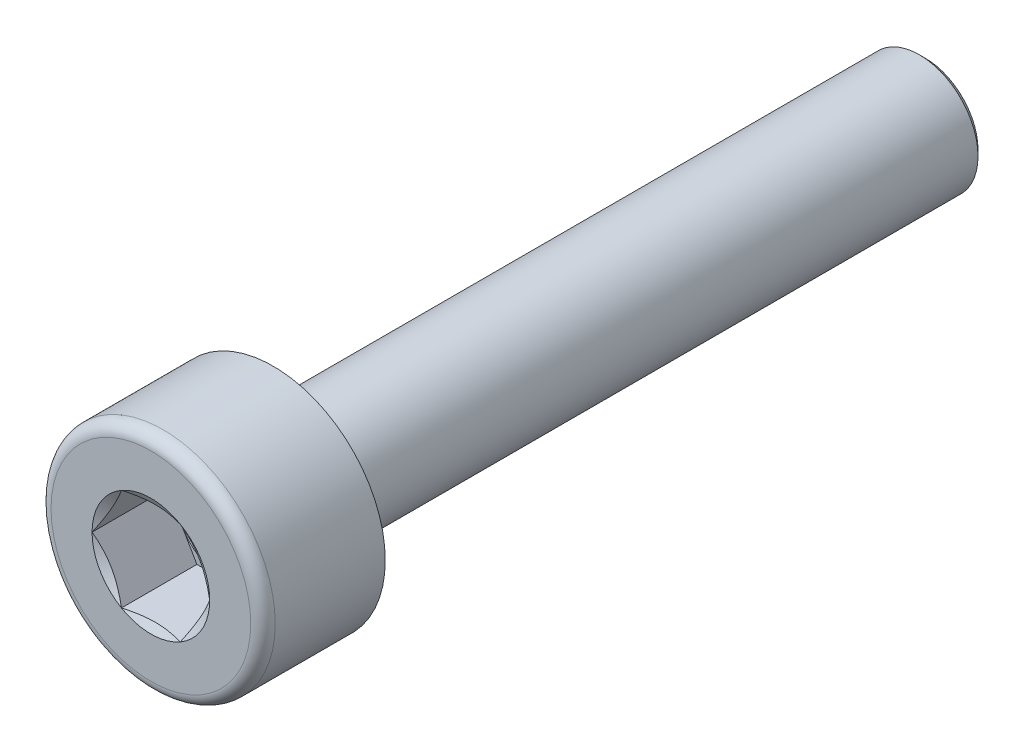
ISO-10303-21;
HEADER;
FILE_DESCRIPTION(('STEP AP214'),'2;1');
FILE_NAME('part.step','',(''),(''),'','','');
FILE_SCHEMA(('AUTOMOTIVE_DESIGN { 1 0 10303 214 1 1 1 1 }'));
ENDSEC;
DATA;
#1=APPLICATION_CONTEXT('core data for automotive mechanical design processes');
#2=APPLICATION_PROTOCOL_DEFINITION('international standard','automotive_design',2000,#1);
#3=PRODUCT_CONTEXT('',#1,'mechanical');
#4=PRODUCT('Part','Part','',(#3));
#5=PRODUCT_RELATED_PRODUCT_CATEGORY('part','',(#4));
#6=PRODUCT_DEFINITION_FORMATION('','',#4);
#7=PRODUCT_DEFINITION_CONTEXT('part definition',#1,'design');
#8=PRODUCT_DEFINITION('design','',#6,#7);
#9=PRODUCT_DEFINITION_SHAPE('','',#8);
#10=(LENGTH_UNIT() NAMED_UNIT(*) SI_UNIT(.MILLI.,.METRE.));
#11=(NAMED_UNIT(*) PLANE_ANGLE_UNIT() SI_UNIT($,.RADIAN.));
#12=(NAMED_UNIT(*) SI_UNIT($,.STERADIAN.) SOLID_ANGLE_UNIT());
#13=UNCERTAINTY_MEASURE_WITH_UNIT(LENGTH_MEASURE(1.E-05),#10,'distance_accuracy_value','');
#14=(GEOMETRIC_REPRESENTATION_CONTEXT(3) GLOBAL_UNCERTAINTY_ASSIGNED_CONTEXT((#13)) GLOBAL_UNIT_ASSIGNED_CONTEXT((#10,
#11,#12)) REPRESENTATION_CONTEXT('',''));
#15=CARTESIAN_POINT('',(0.,0.,0.));
#16=DIRECTION('',(0.,0.,1.));
#17=DIRECTION('',(1.,0.,0.));
#18=AXIS2_PLACEMENT_3D('',#15,#16,#17);
#19=CARTESIAN_POINT('',(0.,1.437,-16.));
#20=DIRECTION('',(0.,0.,1.));
#21=DIRECTION('',(1.,0.,0.));
#22=AXIS2_PLACEMENT_3D('',#19,#20,#21);
#23=PLANE('',#22);
#24=CARTESIAN_POINT('',(0.,0.,-16.));
#25=DIRECTION('',(0.,0.,1.));
#26=DIRECTION('',(1.,0.,0.));
#27=AXIS2_PLACEMENT_3D('',#24,#25,#26);
#28=CIRCLE('',#27,1.2933);
#29=CARTESIAN_POINT('',(1.2933,0.,-16.));
#30=VERTEX_POINT('',#29);
#31=EDGE_CURVE('E25',#30,#30,#28,.F.);
#32=ORIENTED_EDGE('',*,*,#31,.T.);
#33=EDGE_LOOP('',(#32));
#34=FACE_BOUND('',#33,.T.);
#35=ADVANCED_FACE('F17',(#34),#23,.F.);
#36=CARTESIAN_POINT('',(0.,0.,3.));
#37=DIRECTION('',(0.,0.,-1.));
#38=DIRECTION('',(-1.,0.,0.));
#39=AXIS2_PLACEMENT_3D('',#36,#37,#38);
#40=PLANE('',#39);
#41=CARTESIAN_POINT('',(0.,0.,3.));
#42=DIRECTION('',(0.,0.,-1.));
#43=DIRECTION('',(-1.,0.,0.));
#44=AXIS2_PLACEMENT_3D('',#41,#42,#43);
#45=CIRCLE('',#44,2.45);
#46=CARTESIAN_POINT('',(-2.45,0.,3.));
#47=VERTEX_POINT('',#46);
#48=EDGE_CURVE('E273',#47,#47,#45,.F.);
#49=ORIENTED_EDGE('',*,*,#48,.T.);
#50=EDGE_LOOP('',(#49));
#51=FACE_BOUND('',#50,.T.);
#52=CARTESIAN_POINT('',(0.,0.,3.));
#53=DIRECTION('',(0.,0.,-1.));
#54=DIRECTION('',(-1.,0.,0.));
#55=AXIS2_PLACEMENT_3D('',#52,#53,#54);
#56=CIRCLE('',#55,1.44337567297406);
#57=CARTESIAN_POINT('',(-0.721687836487033,-1.25,3.));
#58=VERTEX_POINT('',#57);
#59=CARTESIAN_POINT('',(-1.44337567297406,0.,3.));
#60=VERTEX_POINT('',#59);
#61=EDGE_CURVE('E284',#58,#60,#56,.T.);
#62=ORIENTED_EDGE('',*,*,#61,.T.);
#63=CARTESIAN_POINT('',(-0.72168783648703,1.25,3.));
#64=VERTEX_POINT('',#63);
#65=EDGE_CURVE('E107',#60,#64,#56,.T.);
#66=ORIENTED_EDGE('',*,*,#65,.T.);
#67=CARTESIAN_POINT('',(0.721687836487035,1.25,3.));
#68=VERTEX_POINT('',#67);
#69=EDGE_CURVE('E294',#64,#68,#56,.T.);
#70=ORIENTED_EDGE('',*,*,#69,.T.);
#71=CARTESIAN_POINT('',(1.44337567297406,0.,3.));
#72=VERTEX_POINT('',#71);
#73=EDGE_CURVE('E295',#68,#72,#56,.T.);
#74=ORIENTED_EDGE('',*,*,#73,.T.);
#75=CARTESIAN_POINT('',(0.721687836487033,-1.25,3.));
#76=VERTEX_POINT('',#75);
#77=EDGE_CURVE('E293',#72,#76,#56,.T.);
#78=ORIENTED_EDGE('',*,*,#77,.T.);
#79=EDGE_CURVE('E289',#76,#58,#56,.T.);
#80=ORIENTED_EDGE('',*,*,#79,.T.);
#81=EDGE_LOOP('',(#62,#66,#70,#74,#78,#80));
#82=FACE_BOUND('',#81,.T.);
#83=ADVANCED_FACE('F256',(#51,#82),#40,.F.);
#84=CARTESIAN_POINT('',(0.,0.,0.));
#85=DIRECTION('',(0.,0.,-1.));
#86=DIRECTION('',(-1.,0.,0.));
#87=AXIS2_PLACEMENT_3D('',#84,#85,#86);
#88=CYLINDRICAL_SURFACE('',#87,2.75);
#89=CARTESIAN_POINT('',(0.,0.,2.7));
#90=DIRECTION('',(0.,0.,-1.));
#91=DIRECTION('',(-1.,0.,0.));
#92=AXIS2_PLACEMENT_3D('',#89,#90,#91);
#93=CIRCLE('',#92,2.75);
#94=CARTESIAN_POINT('',(-2.75,0.,2.7));
#95=VERTEX_POINT('',#94);
#96=EDGE_CURVE('E175',#95,#95,#93,.T.);
#97=ORIENTED_EDGE('',*,*,#96,.T.);
#98=EDGE_LOOP('',(#97));
#99=FACE_BOUND('',#98,.T.);
#100=CARTESIAN_POINT('',(0.,0.,0.));
#101=DIRECTION('',(0.,0.,-1.));
#102=DIRECTION('',(-1.,0.,0.));
#103=AXIS2_PLACEMENT_3D('',#100,#101,#102);
#104=CIRCLE('',#103,2.75);
#105=CARTESIAN_POINT('',(-2.75,0.,0.));
#106=VERTEX_POINT('',#105);
#107=EDGE_CURVE('E117',#106,#106,#104,.T.);
#108=ORIENTED_EDGE('',*,*,#107,.F.);
#109=EDGE_LOOP('',(#108));
#110=FACE_BOUND('',#109,.T.);
#111=ADVANCED_FACE('F252',(#99,#110),#88,.T.);
#112=CARTESIAN_POINT('',(0.,2.75,0.));
#113=DIRECTION('',(0.,0.,1.));
#114=DIRECTION('',(1.,0.,0.));
#115=AXIS2_PLACEMENT_3D('',#112,#113,#114);
#116=PLANE('',#115);
#117=CARTESIAN_POINT('',(0.,0.,0.));
#118=DIRECTION('',(0.,0.,-1.));
#119=DIRECTION('',(-1.,0.,0.));
#120=AXIS2_PLACEMENT_3D('',#117,#118,#119);
#121=CIRCLE('',#120,1.8);
#122=CARTESIAN_POINT('',(-1.8,0.,0.));
#123=VERTEX_POINT('',#122);
#124=EDGE_CURVE('E161',#123,#123,#121,.T.);
#125=ORIENTED_EDGE('',*,*,#124,.F.);
#126=EDGE_LOOP('',(#125));
#127=FACE_BOUND('',#126,.T.);
#128=ORIENTED_EDGE('',*,*,#107,.T.);
#129=EDGE_LOOP('',(#128));
#130=FACE_BOUND('',#129,.T.);
#131=ADVANCED_FACE('F248',(#127,#130),#116,.F.);
#132=CARTESIAN_POINT('',(0.,0.,-0.100000000000001));
#133=DIRECTION('',(0.,0.,-1.));
#134=DIRECTION('',(-1.,0.,0.));
#135=AXIS2_PLACEMENT_3D('',#132,#133,#134);
#136=TOROIDAL_SURFACE('',#135,1.8,0.100000000000001);
#137=CARTESIAN_POINT('',(0.,0.,-0.0460072747777011));
#138=DIRECTION('',(0.,0.,-1.));
#139=DIRECTION('',(-1.,0.,0.));
#140=AXIS2_PLACEMENT_3D('',#137,#138,#139);
#141=CIRCLE('',#140,1.71582883140249);
#142=CARTESIAN_POINT('',(-1.71582883140249,0.,-0.0460072747777011));
#143=VERTEX_POINT('',#142);
#144=EDGE_CURVE('E158',#143,#143,#141,.T.);
#145=ORIENTED_EDGE('',*,*,#144,.F.);
#146=EDGE_LOOP('',(#145));
#147=FACE_BOUND('',#146,.T.);
#148=ORIENTED_EDGE('',*,*,#124,.T.);
#149=EDGE_LOOP('',(#148));
#150=FACE_BOUND('',#149,.T.);
#151=ADVANCED_FACE('F244',(#147,#150),#136,.F.);
#152=CARTESIAN_POINT('',(0.,0.,-0.0460072747777011));
#153=DIRECTION('',(0.,0.,1.));
#154=DIRECTION('',(1.,0.,0.));
#155=AXIS2_PLACEMENT_3D('',#152,#153,#154);
#156=CONICAL_SURFACE('',#155,1.71582883140249,0.570350678624392);
#157=CARTESIAN_POINT('',(0.,0.,-0.456007274777701));
#158=DIRECTION('',(0.,0.,-1.));
#159=DIRECTION('',(-1.,0.,0.));
#160=AXIS2_PLACEMENT_3D('',#157,#158,#159);
#161=CIRCLE('',#160,1.4528288314025);
#162=CARTESIAN_POINT('',(-1.4528288314025,0.,-0.456007274777701));
#163=VERTEX_POINT('',#162);
#164=EDGE_CURVE('E155',#163,#163,#161,.T.);
#165=ORIENTED_EDGE('',*,*,#164,.F.);
#166=EDGE_LOOP('',(#165));
#167=FACE_BOUND('',#166,.T.);
#168=ORIENTED_EDGE('',*,*,#144,.T.);
#169=EDGE_LOOP('',(#168));
#170=FACE_BOUND('',#169,.T.);
#171=ADVANCED_FACE('F240',(#167,#170),#156,.T.);
#172=CARTESIAN_POINT('',(0.,0.,-0.51));
#173=DIRECTION('',(0.,0.,-1.));
#174=DIRECTION('',(-1.,0.,0.));
#175=AXIS2_PLACEMENT_3D('',#172,#173,#174);
#176=TOROIDAL_SURFACE('',#175,1.537,0.1);
#177=CARTESIAN_POINT('',(0.,0.,-0.51));
#178=DIRECTION('',(0.,0.,-1.));
#179=DIRECTION('',(-1.,0.,0.));
#180=AXIS2_PLACEMENT_3D('',#177,#178,#179);
#181=CIRCLE('',#180,1.437);
#182=CARTESIAN_POINT('',(-1.437,0.,-0.51));
#183=VERTEX_POINT('',#182);
#184=EDGE_CURVE('E151',#183,#183,#181,.T.);
#185=ORIENTED_EDGE('',*,*,#184,.F.);
#186=EDGE_LOOP('',(#185));
#187=FACE_BOUND('',#186,.T.);
#188=ORIENTED_EDGE('',*,*,#164,.T.);
#189=EDGE_LOOP('',(#188));
#190=FACE_BOUND('',#189,.T.);
#191=ADVANCED_FACE('F236',(#187,#190),#176,.F.);
#192=CARTESIAN_POINT('',(0.,0.,0.));
#193=DIRECTION('',(0.,0.,-1.));
#194=DIRECTION('',(-1.,0.,0.));
#195=AXIS2_PLACEMENT_3D('',#192,#193,#194);
#196=CYLINDRICAL_SURFACE('',#195,1.437);
#197=CARTESIAN_POINT('',(0.,0.,-15.8563));
#198=DIRECTION('',(0.,0.,1.));
#199=DIRECTION('',(1.,0.,0.));
#200=AXIS2_PLACEMENT_3D('',#197,#198,#199);
#201=CIRCLE('',#200,1.437);
#202=CARTESIAN_POINT('',(1.437,0.,-15.8563));
#203=VERTEX_POINT('',#202);
#204=EDGE_CURVE('E11',#203,#203,#201,.T.);
#205=ORIENTED_EDGE('',*,*,#204,.T.);
#206=EDGE_LOOP('',(#205));
#207=FACE_BOUND('',#206,.T.);
#208=ORIENTED_EDGE('',*,*,#184,.T.);
#209=EDGE_LOOP('',(#208));
#210=FACE_BOUND('',#209,.T.);
#211=ADVANCED_FACE('F233',(#207,#210),#196,.T.);
#212=CARTESIAN_POINT('',(0.,0.,3.));
#213=DIRECTION('',(0.,0.,1.));
#214=DIRECTION('',(1.,0.,0.));
#215=AXIS2_PLACEMENT_3D('',#212,#213,#214);
#216=CONICAL_SURFACE('',#215,1.44337567297406,1.04719755119659);
#217=ORIENTED_EDGE('',*,*,#65,.F.);
#218=CARTESIAN_POINT('',(-1.4434911430279,-0.000199999999997675,3.00006667466602));
#219=CARTESIAN_POINT('',(-1.41177538446487,0.0547333052317676,2.98174591476369));
#220=CARTESIAN_POINT('',(-1.37978586023939,0.110140786500242,2.96508330620064));
#221=CARTESIAN_POINT('',(-1.31525277575269,0.221915367600343,2.93599730394577));
#222=CARTESIAN_POINT('',(-1.28270806805991,0.278284454841713,2.92358420197605));
#223=CARTESIAN_POINT('',(-1.21802202146378,0.390323974086987,2.90425968763601));
#224=CARTESIAN_POINT('',(-1.1858906404852,0.445977158459233,2.89721968944743));
#225=CARTESIAN_POINT('',(-1.12147653960455,0.557545653908395,2.88881243263063));
#226=CARTESIAN_POINT('',(-1.08919405413422,0.613460558937603,2.88743821520472));
#227=CARTESIAN_POINT('',(-1.02886247391297,0.717957921181728,2.89028333736792));
#228=CARTESIAN_POINT('',(-1.00080438896118,0.766555949881318,2.89380409882001));
#229=CARTESIAN_POINT('',(-0.944871034195502,0.863435362173241,2.90496711269925));
#230=CARTESIAN_POINT('',(-0.916995958125019,0.911716410192166,2.91261318557268));
#231=CARTESIAN_POINT('',(-0.860947097873546,1.00879588385404,2.93172945470053));
#232=CARTESIAN_POINT('',(-0.832780414607289,1.0575820103519,2.94328075697966));
#233=CARTESIAN_POINT('',(-0.776867365453648,1.1544262522921,2.96949831469389));
#234=CARTESIAN_POINT('',(-0.74912028215514,1.20248561032696,2.9841584021391));
#235=CARTESIAN_POINT('',(-0.721572366433193,1.2502,3.00006667466602));
#236=B_SPLINE_CURVE_WITH_KNOTS('',3,(#218,#219,#220,#221,#222,#223,#224,#225,#226,#227,#228,
#229,#230,#231,#232,#233,#234,#235),.UNSPECIFIED.,.F.,.F.,(4,2,2,2,2,2,2,2,4),(0.,
0.19815082102956,0.396778196315221,0.590488617354401,0.783961049317183,0.952480056398647,
1.1211553973001,1.2935743034359,1.4656542697693),.UNSPECIFIED.);
#237=EDGE_CURVE('E166',#60,#64,#236,.T.);
#238=ORIENTED_EDGE('',*,*,#237,.T.);
#239=EDGE_LOOP('',(#217,#238));
#240=FACE_BOUND('',#239,.T.);
#241=ADVANCED_FACE('F184',(#240),#216,.F.);
#242=CARTESIAN_POINT('',(-0.721572366433195,-1.2502,3.00006667466602));
#243=CARTESIAN_POINT('',(-0.753288124996231,-1.19526669476823,2.98174591476369));
#244=CARTESIAN_POINT('',(-0.785277649221704,-1.13985921349976,2.96508330620064));
#245=CARTESIAN_POINT('',(-0.849810733708404,-1.02808463239966,2.93599730394577));
#246=CARTESIAN_POINT('',(-0.882355441401183,-0.971715545158289,2.92358420197605));
#247=CARTESIAN_POINT('',(-0.947041487997319,-0.859676025913014,2.90425968763601));
#248=CARTESIAN_POINT('',(-0.979172868975895,-0.804022841540769,2.89721968944743));
#249=CARTESIAN_POINT('',(-1.04358696985655,-0.692454346091607,2.88881243263063));
#250=CARTESIAN_POINT('',(-1.07586945532688,-0.636539441062398,2.88743821520472));
#251=CARTESIAN_POINT('',(-1.13620103554813,-0.532042078818273,2.89028333736791));
#252=CARTESIAN_POINT('',(-1.16425912049992,-0.483444050118683,2.89380409882001));
#253=CARTESIAN_POINT('',(-1.22019247526559,-0.386564637826761,2.90496711269926));
#254=CARTESIAN_POINT('',(-1.24806755133608,-0.338283589807835,2.91261318557268));
#255=CARTESIAN_POINT('',(-1.30411641158755,-0.241204116145956,2.93172945470053));
#256=CARTESIAN_POINT('',(-1.33228309485381,-0.1924179896481,2.94328075697966));
#257=CARTESIAN_POINT('',(-1.38819614400745,-0.0955737477078969,2.96949831469389));
#258=CARTESIAN_POINT('',(-1.41594322730596,-0.0475143896730343,2.98415840213911));
#259=CARTESIAN_POINT('',(-1.4434911430279,0.000200000000002268,3.00006667466602));
#260=B_SPLINE_CURVE_WITH_KNOTS('',3,(#242,#243,#244,#245,#246,#247,#248,#249,#250,#251,#252,
#253,#254,#255,#256,#257,#258,#259),.UNSPECIFIED.,.F.,.F.,(4,2,2,2,2,2,2,2,4),(0.,
0.19815082102956,0.396778196315222,0.590488617354402,0.783961049317184,0.952480056398648,
1.1211553973001,1.2935743034359,1.4656542697693),.UNSPECIFIED.);
#261=EDGE_CURVE('E106',#58,#60,#260,.T.);
#262=ORIENTED_EDGE('',*,*,#261,.T.);
#263=ORIENTED_EDGE('',*,*,#61,.F.);
#264=EDGE_LOOP('',(#262,#263));
#265=FACE_BOUND('',#264,.T.);
#266=ADVANCED_FACE('F339',(#265),#216,.F.);
#267=CARTESIAN_POINT('',(-1.91402249686216,-1.25,3.48651288479141));
#268=CARTESIAN_POINT('',(-1.85914046049582,-1.25,3.45999038335154));
#269=CARTESIAN_POINT('',(-1.80412861642413,-1.25,3.43373221461557));
#270=CARTESIAN_POINT('',(-1.69377524880197,-1.25,3.38189383879485));
#271=CARTESIAN_POINT('',(-1.63843367017623,-1.25,3.35631374909162));
#272=CARTESIAN_POINT('',(-1.52705181896546,-1.25,3.30584606568502));
#273=CARTESIAN_POINT('',(-1.471009360369,-1.25,3.28096327255609));
#274=CARTESIAN_POINT('',(-1.3584634322514,-1.25,3.23227191506865));
#275=CARTESIAN_POINT('',(-1.30195998694251,-1.25,3.20846329471518));
#276=CARTESIAN_POINT('',(-1.13023285932381,-1.25,3.13847265448235));
#277=CARTESIAN_POINT('',(-1.01415191825627,-1.25,3.09435658102078));
#278=CARTESIAN_POINT('',(-0.779052794443726,-1.25,3.01526341646949));
#279=CARTESIAN_POINT('',(-0.660042536750821,-1.25,2.98026411818164));
#280=CARTESIAN_POINT('',(-0.47893263622699,-1.25,2.93885499673143));
#281=CARTESIAN_POINT('',(-0.418117317139982,-1.25,2.92689892661569));
#282=CARTESIAN_POINT('',(-0.295751634794787,-1.25,2.90750168027795));
#283=CARTESIAN_POINT('',(-0.234201270886778,-1.25,2.90006050804768));
#284=CARTESIAN_POINT('',(-0.111078085132805,-1.25,2.89034953143358));
#285=CARTESIAN_POINT('',(-0.0495079196542184,-1.25,2.88804698816604));
#286=CARTESIAN_POINT('',(0.0735831621738639,-1.25,2.88872894537047));
#287=CARTESIAN_POINT('',(0.135104087159245,-1.25,2.89171207343273));
#288=CARTESIAN_POINT('',(0.283935785341007,-1.25,2.90505722791002));
#289=CARTESIAN_POINT('',(0.371012804095998,-1.25,2.91803134932696));
#290=CARTESIAN_POINT('',(0.543555810943381,-1.25,2.95222917957144));
#291=CARTESIAN_POINT('',(0.629019779096373,-1.25,2.9734625943366));
#292=CARTESIAN_POINT('',(0.756929416866877,-1.25,3.01007884490288));
#293=CARTESIAN_POINT('',(0.800029095074483,-1.25,3.02326523899134));
#294=CARTESIAN_POINT('',(0.885776202763547,-1.25,3.05094330554174));
#295=CARTESIAN_POINT('',(0.928423921808507,-1.25,3.06543407771215));
#296=CARTESIAN_POINT('',(1.01309180163563,-1.25,3.09541882069064));
#297=CARTESIAN_POINT('',(1.05511414357455,-1.25,3.11090668572693));
#298=CARTESIAN_POINT('',(1.13883279115284,-1.25,3.14279147043058));
#299=CARTESIAN_POINT('',(1.1805289571388,-1.25,3.15918875750689));
#300=CARTESIAN_POINT('',(1.22207405933337,-1.25,3.175951067698));
#301=B_SPLINE_CURVE_WITH_KNOTS('',3,(#267,#268,#269,#270,#271,#272,#273,#274,#275,#276,#277,
#278,#279,#280,#281,#282,#283,#284,#285,#286,#287,#288,#289,#290,#291,#292,#293,#294,#295,#296,
#297,#298,#299,#300),.UNSPECIFIED.,.F.,.F.,(4,2,2,2,2,2,2,2,2,2,2,2,2,2,2,2,4),(0.,
0.182866185166336,0.365763822062273,0.549708108268721,0.733642794640087,1.10600436119169,
1.47745024072251,1.66325057096118,1.84905106547046,2.03366437966803,2.21822976656131,
2.48180397426805,2.74568886248364,2.88088820791444,3.01599494297259,3.15034120655594,
3.28474214746062),.UNSPECIFIED.);
#302=EDGE_CURVE('E197',#76,#58,#301,.F.);
#303=ORIENTED_EDGE('',*,*,#302,.T.);
#304=ORIENTED_EDGE('',*,*,#79,.F.);
#305=EDGE_LOOP('',(#303,#304));
#306=FACE_BOUND('',#305,.T.);
#307=ADVANCED_FACE('F343',(#306),#216,.F.);
#308=CARTESIAN_POINT('',(1.4434911430279,0.000199999999998967,3.00006667466602));
#309=CARTESIAN_POINT('',(1.41177538446487,-0.0547333052317663,2.98174591476369));
#310=CARTESIAN_POINT('',(1.37978586023939,-0.110140786500241,2.96508330620064));
#311=CARTESIAN_POINT('',(1.31525277575269,-0.221915367600341,2.93599730394577));
#312=CARTESIAN_POINT('',(1.28270806805991,-0.278284454841712,2.92358420197605));
#313=CARTESIAN_POINT('',(1.21802202146378,-0.390323974086986,2.90425968763601));
#314=CARTESIAN_POINT('',(1.1858906404852,-0.445977158459232,2.89721968944743));
#315=CARTESIAN_POINT('',(1.12147653960455,-0.557545653908394,2.88881243263063));
#316=CARTESIAN_POINT('',(1.08919405413422,-0.613460558937602,2.88743821520472));
#317=CARTESIAN_POINT('',(1.02886247391297,-0.717957921181727,2.89028333736791));
#318=CARTESIAN_POINT('',(1.00080438896118,-0.766555949881317,2.89380409882001));
#319=CARTESIAN_POINT('',(0.944871034195502,-0.863435362173239,2.90496711269925));
#320=CARTESIAN_POINT('',(0.916995958125019,-0.911716410192164,2.91261318557268));
#321=CARTESIAN_POINT('',(0.860947097873545,-1.00879588385404,2.93172945470053));
#322=CARTESIAN_POINT('',(0.832780414607289,-1.0575820103519,2.94328075697966));
#323=CARTESIAN_POINT('',(0.776867365453648,-1.1544262522921,2.96949831469389));
#324=CARTESIAN_POINT('',(0.749120282155139,-1.20248561032696,2.9841584021391));
#325=CARTESIAN_POINT('',(0.721572366433193,-1.2502,3.00006667466602));
#326=B_SPLINE_CURVE_WITH_KNOTS('',3,(#308,#309,#310,#311,#312,#313,#314,#315,#316,#317,#318,
#319,#320,#321,#322,#323,#324,#325),.UNSPECIFIED.,.F.,.F.,(4,2,2,2,2,2,2,2,4),(0.,
0.19815082102956,0.396778196315222,0.590488617354401,0.783961049317183,0.952480056398647,
1.1211553973001,1.2935743034359,1.4656542697693),.UNSPECIFIED.);
#327=EDGE_CURVE('E204',#72,#76,#326,.T.);
#328=ORIENTED_EDGE('',*,*,#327,.T.);
#329=ORIENTED_EDGE('',*,*,#77,.F.);
#330=EDGE_LOOP('',(#328,#329));
#331=FACE_BOUND('',#330,.T.);
#332=ADVANCED_FACE('F299',(#331),#216,.F.);
#333=CARTESIAN_POINT('',(0.721572366433196,1.2502,3.00006667466602));
#334=CARTESIAN_POINT('',(0.753288124996232,1.19526669476823,2.98174591476369));
#335=CARTESIAN_POINT('',(0.785277649221705,1.13985921349976,2.96508330620064));
#336=CARTESIAN_POINT('',(0.849810733708406,1.02808463239966,2.93599730394577));
#337=CARTESIAN_POINT('',(0.882355441401184,0.971715545158289,2.92358420197605));
#338=CARTESIAN_POINT('',(0.94704148799732,0.859676025913015,2.90425968763601));
#339=CARTESIAN_POINT('',(0.979172868975896,0.80402284154077,2.89721968944743));
#340=CARTESIAN_POINT('',(1.04358696985655,0.692454346091607,2.88881243263063));
#341=CARTESIAN_POINT('',(1.07586945532687,0.636539441062397,2.88743821520472));
#342=CARTESIAN_POINT('',(1.13620103554813,0.532042078818272,2.89028333736792));
#343=CARTESIAN_POINT('',(1.16425912049992,0.483444050118682,2.89380409882001));
#344=CARTESIAN_POINT('',(1.2201924752656,0.38656463782676,2.90496711269925));
#345=CARTESIAN_POINT('',(1.24806755133608,0.338283589807835,2.91261318557268));
#346=CARTESIAN_POINT('',(1.30411641158755,0.241204116145956,2.93172945470053));
#347=CARTESIAN_POINT('',(1.33228309485381,0.1924179896481,2.94328075697966));
#348=CARTESIAN_POINT('',(1.38819614400745,0.0955737477078979,2.96949831469389));
#349=CARTESIAN_POINT('',(1.41594322730596,0.0475143896730355,2.98415840213911));
#350=CARTESIAN_POINT('',(1.4434911430279,-0.00020000000000122,3.00006667466602));
#351=B_SPLINE_CURVE_WITH_KNOTS('',3,(#333,#334,#335,#336,#337,#338,#339,#340,#341,#342,#343,
#344,#345,#346,#347,#348,#349,#350),.UNSPECIFIED.,.F.,.F.,(4,2,2,2,2,2,2,2,4),(0.,
0.19815082102956,0.396778196315222,0.590488617354401,0.783961049317184,0.952480056398648,
1.1211553973001,1.2935743034359,1.4656542697693),.UNSPECIFIED.);
#352=EDGE_CURVE('E37',#68,#72,#351,.T.);
#353=ORIENTED_EDGE('',*,*,#352,.T.);
#354=ORIENTED_EDGE('',*,*,#73,.F.);
#355=EDGE_LOOP('',(#353,#354));
#356=FACE_BOUND('',#355,.T.);
#357=ADVANCED_FACE('F183',(#356),#216,.F.);
#358=CARTESIAN_POINT('',(-1.91402249686216,1.25,3.48651288479141));
#359=CARTESIAN_POINT('',(-1.85914046049581,1.25,3.45999038335154));
#360=CARTESIAN_POINT('',(-1.80412861642413,1.25,3.43373221461557));
#361=CARTESIAN_POINT('',(-1.69377524880197,1.25,3.38189383879485));
#362=CARTESIAN_POINT('',(-1.63843367017622,1.25,3.35631374909161));
#363=CARTESIAN_POINT('',(-1.52705181896546,1.25,3.30584606568501));
#364=CARTESIAN_POINT('',(-1.471009360369,1.25,3.28096327255609));
#365=CARTESIAN_POINT('',(-1.35846343225139,1.25,3.23227191506865));
#366=CARTESIAN_POINT('',(-1.3019599869425,1.25,3.20846329471518));
#367=CARTESIAN_POINT('',(-1.13023285932381,1.25,3.13847265448235));
#368=CARTESIAN_POINT('',(-1.01415191825627,1.25,3.09435658102077));
#369=CARTESIAN_POINT('',(-0.779052794443723,1.25,3.01526341646949));
#370=CARTESIAN_POINT('',(-0.660042536750817,1.25,2.98026411818164));
#371=CARTESIAN_POINT('',(-0.478932636226987,1.25,2.93885499673143));
#372=CARTESIAN_POINT('',(-0.418117317139979,1.25,2.92689892661569));
#373=CARTESIAN_POINT('',(-0.295751634794785,1.25,2.90750168027795));
#374=CARTESIAN_POINT('',(-0.234201270886775,1.25,2.90006050804768));
#375=CARTESIAN_POINT('',(-0.111078085132802,1.25,2.89034953143358));
#376=CARTESIAN_POINT('',(-0.0495079196542156,1.25,2.88804698816604));
#377=CARTESIAN_POINT('',(0.0735831621738667,1.25,2.88872894537047));
#378=CARTESIAN_POINT('',(0.135104087159248,1.25,2.89171207343273));
#379=CARTESIAN_POINT('',(0.283935785341009,1.25,2.90505722791002));
#380=CARTESIAN_POINT('',(0.371012804096,1.25,2.91803134932696));
#381=CARTESIAN_POINT('',(0.543555810943384,1.25,2.95222917957144));
#382=CARTESIAN_POINT('',(0.629019779096376,1.25,2.9734625943366));
#383=CARTESIAN_POINT('',(0.75692941686688,1.25,3.01007884490288));
#384=CARTESIAN_POINT('',(0.800029095074486,1.25,3.02326523899134));
#385=CARTESIAN_POINT('',(0.88577620276355,1.25,3.05094330554174));
#386=CARTESIAN_POINT('',(0.92842392180851,1.25,3.06543407771215));
#387=CARTESIAN_POINT('',(1.01309180163563,1.25,3.09541882069064));
#388=CARTESIAN_POINT('',(1.05511414357455,1.25,3.11090668572694));
#389=CARTESIAN_POINT('',(1.13883279115285,1.25,3.14279147043058));
#390=CARTESIAN_POINT('',(1.1805289571388,1.25,3.15918875750689));
#391=CARTESIAN_POINT('',(1.22207405933337,1.25,3.175951067698));
#392=B_SPLINE_CURVE_WITH_KNOTS('',3,(#358,#359,#360,#361,#362,#363,#364,#365,#366,#367,#368,
#369,#370,#371,#372,#373,#374,#375,#376,#377,#378,#379,#380,#381,#382,#383,#384,#385,#386,#387,
#388,#389,#390,#391),.UNSPECIFIED.,.F.,.F.,(4,2,2,2,2,2,2,2,2,2,2,2,2,2,2,2,4),(0.,
0.182866185166335,0.365763822062272,0.549708108268719,0.733642794640086,1.10600436119169,
1.47745024072251,1.66325057096118,1.84905106547045,2.03366437966803,2.21822976656131,
2.48180397426804,2.74568886248363,2.88088820791444,3.01599494297259,3.15034120655594,
3.28474214746062),.UNSPECIFIED.);
#393=EDGE_CURVE('E31',#64,#68,#392,.T.);
#394=ORIENTED_EDGE('',*,*,#393,.T.);
#395=ORIENTED_EDGE('',*,*,#69,.F.);
#396=EDGE_LOOP('',(#394,#395));
#397=FACE_BOUND('',#396,.T.);
#398=ADVANCED_FACE('F180',(#397),#216,.F.);
#399=CARTESIAN_POINT('',(0.721687836487034,1.25,1.15));
#400=DIRECTION('',(0.,0.,-1.));
#401=DIRECTION('',(-1.,0.,0.));
#402=AXIS2_PLACEMENT_3D('',#399,#400,#401);
#403=PLANE('',#402);
#404=CARTESIAN_POINT('',(0.,0.,1.15));
#405=DIRECTION('',(0.,0.,-1.));
#406=DIRECTION('',(-1.,0.,0.));
#407=AXIS2_PLACEMENT_3D('',#404,#405,#406);
#408=CIRCLE('',#407,1.25);
#409=CARTESIAN_POINT('',(-1.08253175473055,0.625,1.15));
#410=VERTEX_POINT('',#409);
#411=CARTESIAN_POINT('',(0.,1.25,1.15));
#412=VERTEX_POINT('',#411);
#413=EDGE_CURVE('E96',#410,#412,#408,.T.);
#414=ORIENTED_EDGE('',*,*,#413,.T.);
#415=DIRECTION('',(1.,0.,0.));
#416=VECTOR('',#415,1.);
#417=CARTESIAN_POINT('',(-0.721687836487031,1.25,1.15));
#418=LINE('',#417,#416);
#419=CARTESIAN_POINT('',(-0.721687836487031,1.25,1.15));
#420=VERTEX_POINT('',#419);
#421=EDGE_CURVE('E123',#420,#412,#418,.T.);
#422=ORIENTED_EDGE('',*,*,#421,.F.);
#423=DIRECTION('',(0.5,0.866025403784438,0.));
#424=VECTOR('',#423,1.);
#425=CARTESIAN_POINT('',(-1.44337567297406,0.,1.15));
#426=LINE('',#425,#424);
#427=EDGE_CURVE('E120',#410,#420,#426,.T.);
#428=ORIENTED_EDGE('',*,*,#427,.F.);
#429=EDGE_LOOP('',(#414,#422,#428));
#430=FACE_BOUND('',#429,.T.);
#431=ADVANCED_FACE('F121',(#430),#403,.F.);
#432=CARTESIAN_POINT('',(0.,0.,1.15));
#433=DIRECTION('',(0.,0.,-1.));
#434=DIRECTION('',(-1.,0.,0.));
#435=AXIS2_PLACEMENT_3D('',#432,#433,#434);
#436=CIRCLE('',#435,1.25);
#437=CARTESIAN_POINT('',(-1.08253175473055,-0.625,1.15));
#438=VERTEX_POINT('',#437);
#439=EDGE_CURVE('E98',#410,#438,#436,.F.);
#440=ORIENTED_EDGE('',*,*,#439,.F.);
#441=CARTESIAN_POINT('',(-1.44337567297406,0.,1.15));
#442=VERTEX_POINT('',#441);
#443=EDGE_CURVE('E114',#442,#410,#426,.T.);
#444=ORIENTED_EDGE('',*,*,#443,.F.);
#445=DIRECTION('',(-0.5,0.866025403784439,0.));
#446=VECTOR('',#445,1.);
#447=CARTESIAN_POINT('',(-0.721687836487033,-1.25,1.15));
#448=LINE('',#447,#446);
#449=EDGE_CURVE('E115',#438,#442,#448,.T.);
#450=ORIENTED_EDGE('',*,*,#449,.F.);
#451=EDGE_LOOP('',(#440,#444,#450));
#452=FACE_BOUND('',#451,.T.);
#453=ADVANCED_FACE('F112',(#452),#403,.F.);
#454=CARTESIAN_POINT('',(-1.44337567297406,0.,3.));
#455=DIRECTION('',(-0.866025403784438,0.5,0.));
#456=DIRECTION('',(-0.5,-0.866025403784438,0.));
#457=AXIS2_PLACEMENT_3D('',#454,#455,#456);
#458=PLANE('',#457);
#459=ORIENTED_EDGE('',*,*,#443,.T.);
#460=ORIENTED_EDGE('',*,*,#427,.T.);
#461=DIRECTION('',(0.,0.,-1.));
#462=VECTOR('',#461,1.);
#463=CARTESIAN_POINT('',(-0.721687836487031,1.25,3.));
#464=LINE('',#463,#462);
#465=EDGE_CURVE('E134',#64,#420,#464,.T.);
#466=ORIENTED_EDGE('',*,*,#465,.F.);
#467=ORIENTED_EDGE('',*,*,#237,.F.);
#468=DIRECTION('',(0.,0.,-1.));
#469=VECTOR('',#468,1.);
#470=CARTESIAN_POINT('',(-1.44337567297406,0.,3.));
#471=LINE('',#470,#469);
#472=EDGE_CURVE('E133',#60,#442,#471,.T.);
#473=ORIENTED_EDGE('',*,*,#472,.T.);
#474=EDGE_LOOP('',(#459,#460,#466,#467,#473));
#475=FACE_BOUND('',#474,.T.);
#476=ADVANCED_FACE('F130',(#475),#458,.F.);
#477=CARTESIAN_POINT('',(0.,-1.25,1.15));
#478=VERTEX_POINT('',#477);
#479=EDGE_CURVE('E119',#438,#478,#436,.F.);
#480=ORIENTED_EDGE('',*,*,#479,.F.);
#481=CARTESIAN_POINT('',(-0.721687836487033,-1.25,1.15));
#482=VERTEX_POINT('',#481);
#483=EDGE_CURVE('E127',#482,#438,#448,.T.);
#484=ORIENTED_EDGE('',*,*,#483,.F.);
#485=DIRECTION('',(-1.,0.,0.));
#486=VECTOR('',#485,1.);
#487=CARTESIAN_POINT('',(0.721687836487031,-1.25,1.15));
#488=LINE('',#487,#486);
#489=EDGE_CURVE('E318',#478,#482,#488,.T.);
#490=ORIENTED_EDGE('',*,*,#489,.F.);
#491=EDGE_LOOP('',(#480,#484,#490));
#492=FACE_BOUND('',#491,.T.);
#493=ADVANCED_FACE('F331',(#492),#403,.F.);
#494=CARTESIAN_POINT('',(-0.721687836487033,-1.25,3.));
#495=DIRECTION('',(-0.866025403784439,-0.5,0.));
#496=DIRECTION('',(0.5,-0.866025403784439,0.));
#497=AXIS2_PLACEMENT_3D('',#494,#495,#496);
#498=PLANE('',#497);
#499=ORIENTED_EDGE('',*,*,#483,.T.);
#500=ORIENTED_EDGE('',*,*,#449,.T.);
#501=ORIENTED_EDGE('',*,*,#472,.F.);
#502=ORIENTED_EDGE('',*,*,#261,.F.);
#503=DIRECTION('',(0.,0.,-1.));
#504=VECTOR('',#503,1.);
#505=CARTESIAN_POINT('',(-0.721687836487033,-1.25,3.));
#506=LINE('',#505,#504);
#507=EDGE_CURVE('E140',#58,#482,#506,.T.);
#508=ORIENTED_EDGE('',*,*,#507,.T.);
#509=EDGE_LOOP('',(#499,#500,#501,#502,#508));
#510=FACE_BOUND('',#509,.T.);
#511=ADVANCED_FACE('F330',(#510),#498,.F.);
#512=CARTESIAN_POINT('',(1.08253175473055,-0.625,1.15));
#513=VERTEX_POINT('',#512);
#514=EDGE_CURVE('E333',#478,#513,#436,.F.);
#515=ORIENTED_EDGE('',*,*,#514,.F.);
#516=CARTESIAN_POINT('',(0.721687836487031,-1.25,1.15));
#517=VERTEX_POINT('',#516);
#518=EDGE_CURVE('E319',#517,#478,#488,.T.);
#519=ORIENTED_EDGE('',*,*,#518,.F.);
#520=DIRECTION('',(-0.5,-0.866025403784438,0.));
#521=VECTOR('',#520,1.);
#522=CARTESIAN_POINT('',(1.44337567297406,0.,1.15));
#523=LINE('',#522,#521);
#524=EDGE_CURVE('E314',#513,#517,#523,.T.);
#525=ORIENTED_EDGE('',*,*,#524,.F.);
#526=EDGE_LOOP('',(#515,#519,#525));
#527=FACE_BOUND('',#526,.T.);
#528=ADVANCED_FACE('F349',(#527),#403,.F.);
#529=CARTESIAN_POINT('',(0.721687836487031,-1.25,3.));
#530=DIRECTION('',(0.,-1.,0.));
#531=DIRECTION('',(0.,0.,-1.));
#532=AXIS2_PLACEMENT_3D('',#529,#530,#531);
#533=PLANE('',#532);
#534=ORIENTED_EDGE('',*,*,#518,.T.);
#535=ORIENTED_EDGE('',*,*,#489,.T.);
#536=ORIENTED_EDGE('',*,*,#507,.F.);
#537=ORIENTED_EDGE('',*,*,#302,.F.);
#538=DIRECTION('',(0.,0.,-1.));
#539=VECTOR('',#538,1.);
#540=CARTESIAN_POINT('',(0.721687836487031,-1.25,3.));
#541=LINE('',#540,#539);
#542=EDGE_CURVE('E143',#76,#517,#541,.T.);
#543=ORIENTED_EDGE('',*,*,#542,.T.);
#544=EDGE_LOOP('',(#534,#535,#536,#537,#543));
#545=FACE_BOUND('',#544,.T.);
#546=ADVANCED_FACE('F325',(#545),#533,.F.);
#547=CARTESIAN_POINT('',(1.08253175473055,0.625,1.15));
#548=VERTEX_POINT('',#547);
#549=EDGE_CURVE('E334',#513,#548,#436,.F.);
#550=ORIENTED_EDGE('',*,*,#549,.F.);
#551=CARTESIAN_POINT('',(1.44337567297406,0.,1.15));
#552=VERTEX_POINT('',#551);
#553=EDGE_CURVE('E317',#552,#513,#523,.T.);
#554=ORIENTED_EDGE('',*,*,#553,.F.);
#555=DIRECTION('',(0.5,-0.866025403784439,0.));
#556=VECTOR('',#555,1.);
#557=CARTESIAN_POINT('',(0.721687836487034,1.25,1.15));
#558=LINE('',#557,#556);
#559=EDGE_CURVE('E308',#548,#552,#558,.T.);
#560=ORIENTED_EDGE('',*,*,#559,.F.);
#561=EDGE_LOOP('',(#550,#554,#560));
#562=FACE_BOUND('',#561,.T.);
#563=ADVANCED_FACE('F350',(#562),#403,.F.);
#564=CARTESIAN_POINT('',(1.44337567297406,0.,3.));
#565=DIRECTION('',(0.866025403784438,-0.5,0.));
#566=DIRECTION('',(0.5,0.866025403784438,0.));
#567=AXIS2_PLACEMENT_3D('',#564,#565,#566);
#568=PLANE('',#567);
#569=ORIENTED_EDGE('',*,*,#553,.T.);
#570=ORIENTED_EDGE('',*,*,#524,.T.);
#571=ORIENTED_EDGE('',*,*,#542,.F.);
#572=ORIENTED_EDGE('',*,*,#327,.F.);
#573=DIRECTION('',(0.,0.,-1.));
#574=VECTOR('',#573,1.);
#575=CARTESIAN_POINT('',(1.44337567297406,0.,3.));
#576=LINE('',#575,#574);
#577=EDGE_CURVE('E146',#72,#552,#576,.T.);
#578=ORIENTED_EDGE('',*,*,#577,.T.);
#579=EDGE_LOOP('',(#569,#570,#571,#572,#578));
#580=FACE_BOUND('',#579,.T.);
#581=ADVANCED_FACE('F227',(#580),#568,.F.);
#582=EDGE_CURVE('E101',#548,#412,#436,.F.);
#583=ORIENTED_EDGE('',*,*,#582,.F.);
#584=CARTESIAN_POINT('',(0.721687836487034,1.25,1.15));
#585=VERTEX_POINT('',#584);
#586=EDGE_CURVE('E310',#585,#548,#558,.T.);
#587=ORIENTED_EDGE('',*,*,#586,.F.);
#588=EDGE_CURVE('E315',#412,#585,#418,.T.);
#589=ORIENTED_EDGE('',*,*,#588,.F.);
#590=EDGE_LOOP('',(#583,#587,#589));
#591=FACE_BOUND('',#590,.T.);
#592=ADVANCED_FACE('F225',(#591),#403,.F.);
#593=CARTESIAN_POINT('',(0.721687836487034,1.25,3.));
#594=DIRECTION('',(0.866025403784439,0.5,0.));
#595=DIRECTION('',(-0.5,0.866025403784439,0.));
#596=AXIS2_PLACEMENT_3D('',#593,#594,#595);
#597=PLANE('',#596);
#598=ORIENTED_EDGE('',*,*,#586,.T.);
#599=ORIENTED_EDGE('',*,*,#559,.T.);
#600=ORIENTED_EDGE('',*,*,#577,.F.);
#601=ORIENTED_EDGE('',*,*,#352,.F.);
#602=DIRECTION('',(0.,0.,-1.));
#603=VECTOR('',#602,1.);
#604=CARTESIAN_POINT('',(0.721687836487034,1.25,3.));
#605=LINE('',#604,#603);
#606=EDGE_CURVE('E149',#68,#585,#605,.T.);
#607=ORIENTED_EDGE('',*,*,#606,.T.);
#608=EDGE_LOOP('',(#598,#599,#600,#601,#607));
#609=FACE_BOUND('',#608,.T.);
#610=ADVANCED_FACE('F222',(#609),#597,.F.);
#611=CARTESIAN_POINT('',(-0.721687836487031,1.25,3.));
#612=DIRECTION('',(0.,1.,0.));
#613=DIRECTION('',(0.,0.,1.));
#614=AXIS2_PLACEMENT_3D('',#611,#612,#613);
#615=PLANE('',#614);
#616=ORIENTED_EDGE('',*,*,#421,.T.);
#617=ORIENTED_EDGE('',*,*,#588,.T.);
#618=ORIENTED_EDGE('',*,*,#606,.F.);
#619=ORIENTED_EDGE('',*,*,#393,.F.);
#620=ORIENTED_EDGE('',*,*,#465,.T.);
#621=EDGE_LOOP('',(#616,#617,#618,#619,#620));
#622=FACE_BOUND('',#621,.T.);
#623=ADVANCED_FACE('F93',(#622),#615,.F.);
#624=CARTESIAN_POINT('',(0.,0.,1.15));
#625=DIRECTION('',(0.,0.,1.));
#626=DIRECTION('',(1.,0.,0.));
#627=AXIS2_PLACEMENT_3D('',#624,#625,#626);
#628=CONICAL_SURFACE('',#627,1.25,1.0471975511966);
#629=CARTESIAN_POINT('',(0.,0.,0.428312163512963));
#630=VERTEX_POINT('',#629);
#631=VERTEX_LOOP('',#630);
#632=FACE_BOUND('',#631,.T.);
#633=ORIENTED_EDGE('',*,*,#413,.F.);
#634=ORIENTED_EDGE('',*,*,#439,.T.);
#635=ORIENTED_EDGE('',*,*,#479,.T.);
#636=ORIENTED_EDGE('',*,*,#514,.T.);
#637=ORIENTED_EDGE('',*,*,#549,.T.);
#638=ORIENTED_EDGE('',*,*,#582,.T.);
#639=EDGE_LOOP('',(#633,#634,#635,#636,#637,#638));
#640=FACE_BOUND('',#639,.T.);
#641=ADVANCED_FACE('F89',(#632,#640),#628,.F.);
#642=CARTESIAN_POINT('',(0.,0.,2.7));
#643=DIRECTION('',(0.,0.,-1.));
#644=DIRECTION('',(-1.,0.,0.));
#645=AXIS2_PLACEMENT_3D('',#642,#643,#644);
#646=TOROIDAL_SURFACE('',#645,2.45,0.3);
#647=ORIENTED_EDGE('',*,*,#48,.F.);
#648=EDGE_LOOP('',(#647));
#649=FACE_BOUND('',#648,.T.);
#650=ORIENTED_EDGE('',*,*,#96,.F.);
#651=EDGE_LOOP('',(#650));
#652=FACE_BOUND('',#651,.T.);
#653=ADVANCED_FACE('F92',(#649,#652),#646,.T.);
#654=CARTESIAN_POINT('',(0.,0.,-16.));
#655=DIRECTION('',(0.,0.,1.));
#656=DIRECTION('',(1.,0.,0.));
#657=AXIS2_PLACEMENT_3D('',#654,#655,#656);
#658=CONICAL_SURFACE('',#657,1.2933,0.785398163397448);
#659=ORIENTED_EDGE('',*,*,#204,.F.);
#660=EDGE_LOOP('',(#659));
#661=FACE_BOUND('',#660,.T.);
#662=ORIENTED_EDGE('',*,*,#31,.F.);
#663=EDGE_LOOP('',(#662));
#664=FACE_BOUND('',#663,.T.);
#665=ADVANCED_FACE('F19',(#661,#664),#658,.T.);
#666=CLOSED_SHELL('',(#35,#83,#111,#131,#151,#171,#191,#211,#241,#266,#307,#332,#357,#398,#431,
#453,#476,#493,#511,#528,#546,#563,#581,#592,#610,#623,#641,#653,#665));
#667=MANIFOLD_SOLID_BREP('B1',#666);
#668=ADVANCED_BREP_SHAPE_REPRESENTATION('',(#18,#667),#14);
#669=SHAPE_DEFINITION_REPRESENTATION(#9,#668);
ENDSEC;
END-ISO-10303-21;
